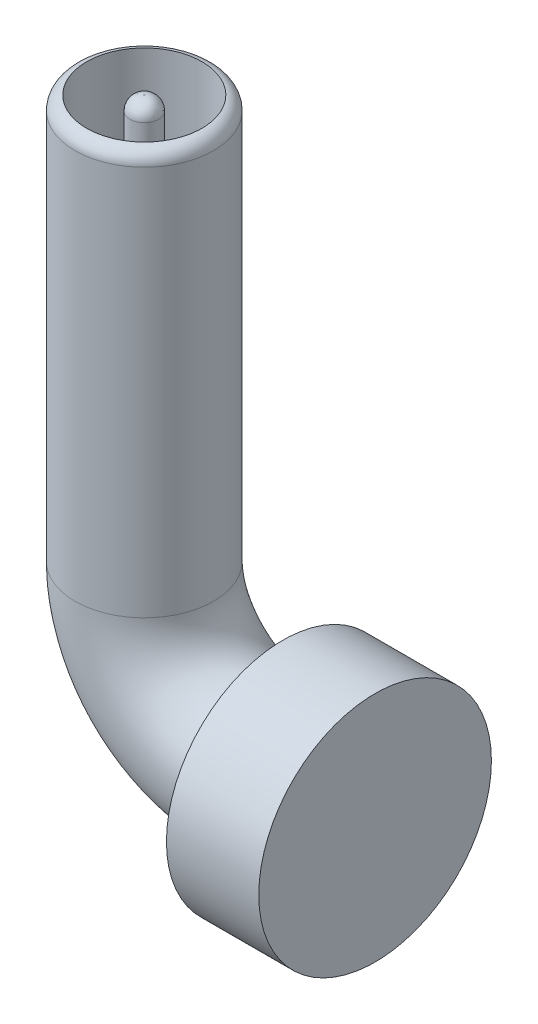
ISO-10303-21;
HEADER;
FILE_DESCRIPTION(('STEP AP214'),'2;1');
FILE_NAME('part.step','',(''),(''),'','','');
FILE_SCHEMA(('AUTOMOTIVE_DESIGN { 1 0 10303 214 1 1 1 1 }'));
ENDSEC;
DATA;
#1=APPLICATION_CONTEXT('core data for automotive mechanical design processes');
#2=APPLICATION_PROTOCOL_DEFINITION('international standard','automotive_design',2000,#1);
#3=PRODUCT_CONTEXT('',#1,'mechanical');
#4=PRODUCT('Part','Part','',(#3));
#5=PRODUCT_RELATED_PRODUCT_CATEGORY('part','',(#4));
#6=PRODUCT_DEFINITION_FORMATION('','',#4);
#7=PRODUCT_DEFINITION_CONTEXT('part definition',#1,'design');
#8=PRODUCT_DEFINITION('design','',#6,#7);
#9=PRODUCT_DEFINITION_SHAPE('','',#8);
#10=(LENGTH_UNIT() NAMED_UNIT(*) SI_UNIT(.MILLI.,.METRE.));
#11=(NAMED_UNIT(*) PLANE_ANGLE_UNIT() SI_UNIT($,.RADIAN.));
#12=(NAMED_UNIT(*) SI_UNIT($,.STERADIAN.) SOLID_ANGLE_UNIT());
#13=UNCERTAINTY_MEASURE_WITH_UNIT(LENGTH_MEASURE(1.E-05),#10,'distance_accuracy_value','');
#14=(GEOMETRIC_REPRESENTATION_CONTEXT(3) GLOBAL_UNCERTAINTY_ASSIGNED_CONTEXT((#13)) GLOBAL_UNIT_ASSIGNED_CONTEXT((#10,
#11,#12)) REPRESENTATION_CONTEXT('',''));
#15=CARTESIAN_POINT('',(0.,0.,0.));
#16=DIRECTION('',(0.,0.,1.));
#17=DIRECTION('',(1.,0.,0.));
#18=AXIS2_PLACEMENT_3D('',#15,#16,#17);
#19=CARTESIAN_POINT('',(-12.7,28.575,0.));
#20=DIRECTION('',(0.,-1.,0.));
#21=DIRECTION('',(1.,0.,0.));
#22=AXIS2_PLACEMENT_3D('',#19,#20,#21);
#23=PLANE('',#22);
#24=CARTESIAN_POINT('',(-12.7,28.575,0.));
#25=DIRECTION('',(0.,-1.,0.));
#26=DIRECTION('',(1.,0.,0.));
#27=AXIS2_PLACEMENT_3D('',#24,#25,#26);
#28=CIRCLE('',#27,0.0317500000000005);
#29=CARTESIAN_POINT('',(-12.66825,28.575,0.));
#30=VERTEX_POINT('',#29);
#31=CARTESIAN_POINT('',(-12.73175,28.575,0.));
#32=VERTEX_POINT('',#31);
#33=EDGE_CURVE('E33',#30,#32,#28,.T.);
#34=ORIENTED_EDGE('',*,*,#33,.F.);
#35=CARTESIAN_POINT('',(-12.7,28.575,0.));
#36=DIRECTION('',(0.,-1.,0.));
#37=DIRECTION('',(-1.,0.,0.));
#38=AXIS2_PLACEMENT_3D('',#35,#36,#37);
#39=CIRCLE('',#38,0.0317499999999953);
#40=EDGE_CURVE('E39',#32,#30,#39,.T.);
#41=ORIENTED_EDGE('',*,*,#40,.F.);
#42=EDGE_LOOP('',(#34,#41));
#43=FACE_BOUND('',#42,.T.);
#44=ADVANCED_FACE('F16',(#43),#23,.F.);
#45=CARTESIAN_POINT('',(-12.66825,27.813,0.));
#46=DIRECTION('',(0.,0.,1.));
#47=DIRECTION('',(1.,0.,0.));
#48=AXIS2_PLACEMENT_3D('',#45,#46,#47);
#49=CIRCLE('',#48,0.762);
#50=TRIMMED_CURVE('',#49,(PARAMETER_VALUE(-1.61247505921747)),
(PARAMETER_VALUE(1.61247505921747)),.T.,.PARAMETER.);
#51=CARTESIAN_POINT('',(-12.7,27.813,0.));
#52=DIRECTION('',(0.,-1.,0.));
#53=AXIS1_PLACEMENT('',#51,#52);
#54=SURFACE_OF_REVOLUTION('',#50,#53);
#55=ORIENTED_EDGE('',*,*,#33,.T.);
#56=ORIENTED_EDGE('',*,*,#40,.T.);
#57=EDGE_LOOP('',(#55,#56));
#58=FACE_BOUND('',#57,.T.);
#59=CARTESIAN_POINT('',(-12.7,27.813,0.));
#60=DIRECTION('',(0.,1.,0.));
#61=DIRECTION('',(-1.,0.,0.));
#62=AXIS2_PLACEMENT_3D('',#59,#60,#61);
#63=CIRCLE('',#62,0.793749999999999);
#64=CARTESIAN_POINT('',(-13.49375,27.813,0.));
#65=VERTEX_POINT('',#64);
#66=EDGE_CURVE('E43',#65,#65,#63,.F.);
#67=ORIENTED_EDGE('',*,*,#66,.F.);
#68=EDGE_LOOP('',(#67));
#69=FACE_BOUND('',#68,.T.);
#70=ADVANCED_FACE('F37',(#58,#69),#54,.F.);
#71=CARTESIAN_POINT('',(0.,0.,0.));
#72=DIRECTION('',(1.,0.,0.));
#73=DIRECTION('',(0.,0.,-1.));
#74=AXIS2_PLACEMENT_3D('',#71,#72,#73);
#75=PLANE('',#74);
#76=CARTESIAN_POINT('',(0.,0.,0.));
#77=DIRECTION('',(1.,0.,0.));
#78=DIRECTION('',(0.,0.,-1.));
#79=AXIS2_PLACEMENT_3D('',#76,#77,#78);
#80=CIRCLE('',#79,6.40181661571805);
#81=CARTESIAN_POINT('',(0.,0.,-6.40181661571805));
#82=VERTEX_POINT('',#81);
#83=EDGE_CURVE('E79',#82,#82,#80,.F.);
#84=ORIENTED_EDGE('',*,*,#83,.F.);
#85=EDGE_LOOP('',(#84));
#86=FACE_BOUND('',#85,.T.);
#87=ADVANCED_FACE('F70',(#86),#75,.T.);
#88=CARTESIAN_POINT('',(-12.7,15.875,0.));
#89=DIRECTION('',(0.,1.,0.));
#90=DIRECTION('',(-1.,0.,0.));
#91=AXIS2_PLACEMENT_3D('',#88,#89,#90);
#92=CYLINDRICAL_SURFACE('',#91,0.793749999999999);
#93=CARTESIAN_POINT('',(-12.7,15.875,0.));
#94=DIRECTION('',(0.,1.,0.));
#95=DIRECTION('',(-1.,0.,0.));
#96=AXIS2_PLACEMENT_3D('',#93,#94,#95);
#97=CIRCLE('',#96,0.793749999999999);
#98=CARTESIAN_POINT('',(-13.49375,15.875,0.));
#99=VERTEX_POINT('',#98);
#100=EDGE_CURVE('E83',#99,#99,#97,.F.);
#101=ORIENTED_EDGE('',*,*,#100,.F.);
#102=EDGE_LOOP('',(#101));
#103=FACE_BOUND('',#102,.T.);
#104=ORIENTED_EDGE('',*,*,#66,.T.);
#105=EDGE_LOOP('',(#104));
#106=FACE_BOUND('',#105,.T.);
#107=ADVANCED_FACE('F133',(#103,#106),#92,.T.);
#108=CARTESIAN_POINT('',(-5.08,0.,0.));
#109=DIRECTION('',(1.,0.,0.));
#110=DIRECTION('',(0.,0.,-1.));
#111=AXIS2_PLACEMENT_3D('',#108,#109,#110);
#112=CYLINDRICAL_SURFACE('',#111,6.40181661571805);
#113=ORIENTED_EDGE('',*,*,#83,.T.);
#114=EDGE_LOOP('',(#113));
#115=FACE_BOUND('',#114,.T.);
#116=CARTESIAN_POINT('',(-5.08,0.,0.));
#117=DIRECTION('',(1.,0.,0.));
#118=DIRECTION('',(0.,0.,-1.));
#119=AXIS2_PLACEMENT_3D('',#116,#117,#118);
#120=CIRCLE('',#119,6.40181661571805);
#121=CARTESIAN_POINT('',(-5.08,0.,-6.40181661571805));
#122=VERTEX_POINT('',#121);
#123=EDGE_CURVE('E87',#122,#122,#120,.T.);
#124=ORIENTED_EDGE('',*,*,#123,.T.);
#125=EDGE_LOOP('',(#124));
#126=FACE_BOUND('',#125,.T.);
#127=ADVANCED_FACE('F131',(#115,#126),#112,.T.);
#128=CARTESIAN_POINT('',(-12.7,15.875,0.));
#129=DIRECTION('',(0.,1.,0.));
#130=DIRECTION('',(-1.,0.,0.));
#131=AXIS2_PLACEMENT_3D('',#128,#129,#130);
#132=PLANE('',#131);
#133=CARTESIAN_POINT('',(-12.7,15.875,0.));
#134=DIRECTION('',(0.,1.,0.));
#135=DIRECTION('',(-1.,0.,0.));
#136=AXIS2_PLACEMENT_3D('',#133,#134,#135);
#137=CIRCLE('',#136,3.175);
#138=CARTESIAN_POINT('',(-15.875,15.875,0.));
#139=VERTEX_POINT('',#138);
#140=EDGE_CURVE('E91',#139,#139,#137,.T.);
#141=ORIENTED_EDGE('',*,*,#140,.T.);
#142=EDGE_LOOP('',(#141));
#143=FACE_BOUND('',#142,.T.);
#144=ORIENTED_EDGE('',*,*,#100,.T.);
#145=EDGE_LOOP('',(#144));
#146=FACE_BOUND('',#145,.T.);
#147=ADVANCED_FACE('F127',(#143,#146),#132,.T.);
#148=CARTESIAN_POINT('',(-5.08,0.,0.));
#149=DIRECTION('',(1.,0.,0.));
#150=DIRECTION('',(0.,0.,-1.));
#151=AXIS2_PLACEMENT_3D('',#148,#149,#150);
#152=PLANE('',#151);
#153=ORIENTED_EDGE('',*,*,#123,.F.);
#154=EDGE_LOOP('',(#153));
#155=FACE_BOUND('',#154,.T.);
#156=CARTESIAN_POINT('',(-5.08,0.,0.));
#157=DIRECTION('',(1.,0.,0.));
#158=DIRECTION('',(0.,1.,0.));
#159=AXIS2_PLACEMENT_3D('',#156,#157,#158);
#160=CIRCLE('',#159,3.81);
#161=CARTESIAN_POINT('',(-5.08,3.81,0.));
#162=VERTEX_POINT('',#161);
#163=EDGE_CURVE('E59',#162,#162,#160,.F.);
#164=ORIENTED_EDGE('',*,*,#163,.F.);
#165=EDGE_LOOP('',(#164));
#166=FACE_BOUND('',#165,.T.);
#167=ADVANCED_FACE('F123',(#155,#166),#152,.F.);
#168=CARTESIAN_POINT('',(-12.7,15.875,0.));
#169=DIRECTION('',(0.,1.,0.));
#170=DIRECTION('',(-1.,0.,0.));
#171=AXIS2_PLACEMENT_3D('',#168,#169,#170);
#172=CYLINDRICAL_SURFACE('',#171,3.175);
#173=ORIENTED_EDGE('',*,*,#140,.F.);
#174=EDGE_LOOP('',(#173));
#175=FACE_BOUND('',#174,.T.);
#176=CARTESIAN_POINT('',(-12.7,28.575,0.));
#177=DIRECTION('',(0.,1.,0.));
#178=DIRECTION('',(-1.,0.,0.));
#179=AXIS2_PLACEMENT_3D('',#176,#177,#178);
#180=CIRCLE('',#179,3.175);
#181=CARTESIAN_POINT('',(-15.875,28.575,0.));
#182=VERTEX_POINT('',#181);
#183=EDGE_CURVE('E96',#182,#182,#180,.F.);
#184=ORIENTED_EDGE('',*,*,#183,.F.);
#185=EDGE_LOOP('',(#184));
#186=FACE_BOUND('',#185,.T.);
#187=ADVANCED_FACE('F120',(#175,#186),#172,.F.);
#188=CARTESIAN_POINT('',(-6.35,0.,0.));
#189=DIRECTION('',(1.,0.,0.));
#190=DIRECTION('',(0.,1.,0.));
#191=AXIS2_PLACEMENT_3D('',#188,#189,#190);
#192=CYLINDRICAL_SURFACE('',#191,3.81);
#193=ORIENTED_EDGE('',*,*,#163,.T.);
#194=EDGE_LOOP('',(#193));
#195=FACE_BOUND('',#194,.T.);
#196=CARTESIAN_POINT('',(-6.35,0.,0.));
#197=DIRECTION('',(-1.,0.,0.));
#198=DIRECTION('',(0.,-1.,0.));
#199=AXIS2_PLACEMENT_3D('',#196,#197,#198);
#200=CIRCLE('',#199,3.81);
#201=CARTESIAN_POINT('',(-6.35,-3.81,0.));
#202=VERTEX_POINT('',#201);
#203=EDGE_CURVE('E100',#202,#202,#200,.T.);
#204=ORIENTED_EDGE('',*,*,#203,.F.);
#205=EDGE_LOOP('',(#204));
#206=FACE_BOUND('',#205,.T.);
#207=ADVANCED_FACE('F116',(#195,#206),#192,.T.);
#208=CARTESIAN_POINT('',(-12.7,27.8236578675463,0.));
#209=DIRECTION('',(0.,1.,0.));
#210=DIRECTION('',(-1.,0.,0.));
#211=AXIS2_PLACEMENT_3D('',#208,#209,#210);
#212=TOROIDAL_SURFACE('',#211,3.048,0.762);
#213=ORIENTED_EDGE('',*,*,#183,.T.);
#214=EDGE_LOOP('',(#213));
#215=FACE_BOUND('',#214,.T.);
#216=CARTESIAN_POINT('',(-12.7,27.8236578675463,0.));
#217=DIRECTION('',(0.,1.,0.));
#218=DIRECTION('',(0.,0.,1.));
#219=AXIS2_PLACEMENT_3D('',#216,#217,#218);
#220=CIRCLE('',#219,3.81);
#221=CARTESIAN_POINT('',(-12.7,27.8236578675463,3.81));
#222=VERTEX_POINT('',#221);
#223=EDGE_CURVE('E11',#222,#222,#220,.F.);
#224=ORIENTED_EDGE('',*,*,#223,.F.);
#225=EDGE_LOOP('',(#224));
#226=FACE_BOUND('',#225,.T.);
#227=ADVANCED_FACE('F111',(#215,#226),#212,.T.);
#228=CARTESIAN_POINT('',(-6.35,6.35,0.));
#229=DIRECTION('',(0.,0.,-1.));
#230=DIRECTION('',(-1.,0.,0.));
#231=AXIS2_PLACEMENT_3D('',#228,#229,#230);
#232=TOROIDAL_SURFACE('',#231,6.35,3.81);
#233=ORIENTED_EDGE('',*,*,#203,.T.);
#234=EDGE_LOOP('',(#233));
#235=FACE_BOUND('',#234,.T.);
#236=CARTESIAN_POINT('',(-12.7,6.35,0.));
#237=DIRECTION('',(0.,1.,0.));
#238=DIRECTION('',(0.,0.,1.));
#239=AXIS2_PLACEMENT_3D('',#236,#237,#238);
#240=CIRCLE('',#239,3.81);
#241=CARTESIAN_POINT('',(-12.7,6.35,3.81));
#242=VERTEX_POINT('',#241);
#243=EDGE_CURVE('E26',#242,#242,#240,.T.);
#244=ORIENTED_EDGE('',*,*,#243,.F.);
#245=EDGE_LOOP('',(#244));
#246=FACE_BOUND('',#245,.T.);
#247=ADVANCED_FACE('F115',(#235,#246),#232,.T.);
#248=CARTESIAN_POINT('',(-12.7,6.35,0.));
#249=DIRECTION('',(0.,1.,0.));
#250=DIRECTION('',(0.,0.,1.));
#251=AXIS2_PLACEMENT_3D('',#248,#249,#250);
#252=CYLINDRICAL_SURFACE('',#251,3.81);
#253=ORIENTED_EDGE('',*,*,#223,.T.);
#254=EDGE_LOOP('',(#253));
#255=FACE_BOUND('',#254,.T.);
#256=ORIENTED_EDGE('',*,*,#243,.T.);
#257=EDGE_LOOP('',(#256));
#258=FACE_BOUND('',#257,.T.);
#259=ADVANCED_FACE('F142',(#255,#258),#252,.T.);
#260=CLOSED_SHELL('',(#44,#70,#87,#107,#127,#147,#167,#187,#207,#227,#247,#259));
#261=MANIFOLD_SOLID_BREP('B1',#260);
#262=ADVANCED_BREP_SHAPE_REPRESENTATION('',(#18,#261),#14);
#263=SHAPE_DEFINITION_REPRESENTATION(#9,#262);
ENDSEC;
END-ISO-10303-21;
